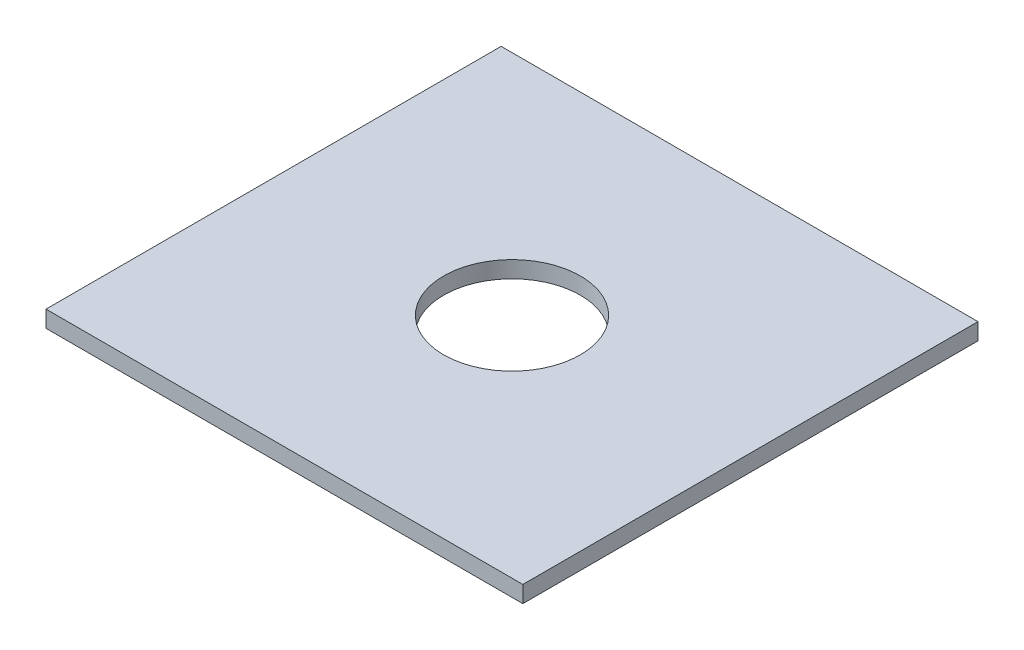
ISO-10303-21;
HEADER;
FILE_DESCRIPTION(('STEP AP214'),'2;1');
FILE_NAME('part.step','',(''),(''),'','','');
FILE_SCHEMA(('AUTOMOTIVE_DESIGN { 1 0 10303 214 1 1 1 1 }'));
ENDSEC;
DATA;
#1=APPLICATION_CONTEXT('core data for automotive mechanical design processes');
#2=APPLICATION_PROTOCOL_DEFINITION('international standard','automotive_design',2000,#1);
#3=PRODUCT_CONTEXT('',#1,'mechanical');
#4=PRODUCT('Part','Part','',(#3));
#5=PRODUCT_RELATED_PRODUCT_CATEGORY('part','',(#4));
#6=PRODUCT_DEFINITION_FORMATION('','',#4);
#7=PRODUCT_DEFINITION_CONTEXT('part definition',#1,'design');
#8=PRODUCT_DEFINITION('design','',#6,#7);
#9=PRODUCT_DEFINITION_SHAPE('','',#8);
#10=(LENGTH_UNIT() NAMED_UNIT(*) SI_UNIT(.MILLI.,.METRE.));
#11=(NAMED_UNIT(*) PLANE_ANGLE_UNIT() SI_UNIT($,.RADIAN.));
#12=(NAMED_UNIT(*) SI_UNIT($,.STERADIAN.) SOLID_ANGLE_UNIT());
#13=UNCERTAINTY_MEASURE_WITH_UNIT(LENGTH_MEASURE(1.E-05),#10,'distance_accuracy_value','');
#14=(GEOMETRIC_REPRESENTATION_CONTEXT(3) GLOBAL_UNCERTAINTY_ASSIGNED_CONTEXT((#13)) GLOBAL_UNIT_ASSIGNED_CONTEXT((#10,
#11,#12)) REPRESENTATION_CONTEXT('',''));
#15=CARTESIAN_POINT('',(0.,0.,0.));
#16=DIRECTION('',(0.,0.,1.));
#17=DIRECTION('',(1.,0.,0.));
#18=AXIS2_PLACEMENT_3D('',#15,#16,#17);
#19=CARTESIAN_POINT('',(0.,10.,0.));
#20=DIRECTION('',(0.,1.,0.));
#21=DIRECTION('',(0.,0.,1.));
#22=AXIS2_PLACEMENT_3D('',#19,#20,#21);
#23=PLANE('',#22);
#24=DIRECTION('',(0.,0.,1.));
#25=VECTOR('',#24,1.);
#26=CARTESIAN_POINT('',(-143.,10.,136.5));
#27=LINE('',#26,#25);
#28=CARTESIAN_POINT('',(-143.,10.,-136.5));
#29=VERTEX_POINT('',#28);
#30=CARTESIAN_POINT('',(-143.,10.,136.5));
#31=VERTEX_POINT('',#30);
#32=EDGE_CURVE('E93',#29,#31,#27,.T.);
#33=ORIENTED_EDGE('',*,*,#32,.T.);
#34=DIRECTION('',(1.,0.,0.));
#35=VECTOR('',#34,1.);
#36=CARTESIAN_POINT('',(143.,10.,136.5));
#37=LINE('',#36,#35);
#38=CARTESIAN_POINT('',(143.,10.,136.5));
#39=VERTEX_POINT('',#38);
#40=EDGE_CURVE('E88',#31,#39,#37,.T.);
#41=ORIENTED_EDGE('',*,*,#40,.T.);
#42=DIRECTION('',(0.,0.,-1.));
#43=VECTOR('',#42,1.);
#44=CARTESIAN_POINT('',(143.,10.,136.5));
#45=LINE('',#44,#43);
#46=CARTESIAN_POINT('',(143.,10.,-136.5));
#47=VERTEX_POINT('',#46);
#48=EDGE_CURVE('E91',#39,#47,#45,.T.);
#49=ORIENTED_EDGE('',*,*,#48,.T.);
#50=DIRECTION('',(-1.,0.,0.));
#51=VECTOR('',#50,1.);
#52=CARTESIAN_POINT('',(143.,10.,-136.5));
#53=LINE('',#52,#51);
#54=EDGE_CURVE('E58',#47,#29,#53,.T.);
#55=ORIENTED_EDGE('',*,*,#54,.T.);
#56=EDGE_LOOP('',(#33,#41,#49,#55));
#57=FACE_BOUND('',#56,.T.);
#58=CARTESIAN_POINT('',(0.,10.,0.));
#59=DIRECTION('',(0.,1.,0.));
#60=DIRECTION('',(0.,0.,1.));
#61=AXIS2_PLACEMENT_3D('',#58,#59,#60);
#62=CIRCLE('',#61,41.);
#63=CARTESIAN_POINT('',(0.,10.,41.0000000000001));
#64=VERTEX_POINT('',#63);
#65=EDGE_CURVE('E108',#64,#64,#62,.T.);
#66=ORIENTED_EDGE('',*,*,#65,.F.);
#67=EDGE_LOOP('',(#66));
#68=FACE_BOUND('',#67,.T.);
#69=ADVANCED_FACE('F41',(#57,#68),#23,.T.);
#70=CARTESIAN_POINT('',(0.,0.,0.));
#71=DIRECTION('',(0.,1.,0.));
#72=DIRECTION('',(0.,0.,1.));
#73=AXIS2_PLACEMENT_3D('',#70,#71,#72);
#74=PLANE('',#73);
#75=DIRECTION('',(0.,0.,1.));
#76=VECTOR('',#75,1.);
#77=CARTESIAN_POINT('',(-143.,0.,136.5));
#78=LINE('',#77,#76);
#79=CARTESIAN_POINT('',(-143.,0.,-136.5));
#80=VERTEX_POINT('',#79);
#81=CARTESIAN_POINT('',(-143.,0.,136.5));
#82=VERTEX_POINT('',#81);
#83=EDGE_CURVE('E105',#80,#82,#78,.T.);
#84=ORIENTED_EDGE('',*,*,#83,.F.);
#85=DIRECTION('',(-1.,0.,0.));
#86=VECTOR('',#85,1.);
#87=CARTESIAN_POINT('',(143.,0.,-136.5));
#88=LINE('',#87,#86);
#89=CARTESIAN_POINT('',(143.,0.,-136.5));
#90=VERTEX_POINT('',#89);
#91=EDGE_CURVE('E81',#90,#80,#88,.T.);
#92=ORIENTED_EDGE('',*,*,#91,.F.);
#93=DIRECTION('',(0.,0.,-1.));
#94=VECTOR('',#93,1.);
#95=CARTESIAN_POINT('',(143.,0.,136.5));
#96=LINE('',#95,#94);
#97=CARTESIAN_POINT('',(143.,0.,136.5));
#98=VERTEX_POINT('',#97);
#99=EDGE_CURVE('E75',#98,#90,#96,.T.);
#100=ORIENTED_EDGE('',*,*,#99,.F.);
#101=DIRECTION('',(1.,0.,0.));
#102=VECTOR('',#101,1.);
#103=CARTESIAN_POINT('',(143.,0.,136.5));
#104=LINE('',#103,#102);
#105=EDGE_CURVE('E97',#82,#98,#104,.T.);
#106=ORIENTED_EDGE('',*,*,#105,.F.);
#107=EDGE_LOOP('',(#84,#92,#100,#106));
#108=FACE_BOUND('',#107,.T.);
#109=CARTESIAN_POINT('',(0.,0.,0.));
#110=DIRECTION('',(0.,1.,0.));
#111=DIRECTION('',(0.,0.,1.));
#112=AXIS2_PLACEMENT_3D('',#109,#110,#111);
#113=CIRCLE('',#112,41.);
#114=CARTESIAN_POINT('',(0.,0.,41.0000000000001));
#115=VERTEX_POINT('',#114);
#116=EDGE_CURVE('E120',#115,#115,#113,.T.);
#117=ORIENTED_EDGE('',*,*,#116,.T.);
#118=EDGE_LOOP('',(#117));
#119=FACE_BOUND('',#118,.T.);
#120=ADVANCED_FACE('F116',(#108,#119),#74,.F.);
#121=CARTESIAN_POINT('',(-143.,10.,136.5));
#122=DIRECTION('',(1.,0.,0.));
#123=DIRECTION('',(0.,0.,-1.));
#124=AXIS2_PLACEMENT_3D('',#121,#122,#123);
#125=PLANE('',#124);
#126=ORIENTED_EDGE('',*,*,#83,.T.);
#127=DIRECTION('',(0.,-1.,0.));
#128=VECTOR('',#127,1.);
#129=CARTESIAN_POINT('',(-143.,10.,136.5));
#130=LINE('',#129,#128);
#131=EDGE_CURVE('E11',#31,#82,#130,.T.);
#132=ORIENTED_EDGE('',*,*,#131,.F.);
#133=ORIENTED_EDGE('',*,*,#32,.F.);
#134=DIRECTION('',(0.,-1.,0.));
#135=VECTOR('',#134,1.);
#136=CARTESIAN_POINT('',(-143.,10.,-136.5));
#137=LINE('',#136,#135);
#138=EDGE_CURVE('E101',#29,#80,#137,.T.);
#139=ORIENTED_EDGE('',*,*,#138,.T.);
#140=EDGE_LOOP('',(#126,#132,#133,#139));
#141=FACE_BOUND('',#140,.T.);
#142=ADVANCED_FACE('F43',(#141),#125,.F.);
#143=CARTESIAN_POINT('',(143.,10.,136.5));
#144=DIRECTION('',(0.,0.,-1.));
#145=DIRECTION('',(-1.,0.,0.));
#146=AXIS2_PLACEMENT_3D('',#143,#144,#145);
#147=PLANE('',#146);
#148=ORIENTED_EDGE('',*,*,#105,.T.);
#149=DIRECTION('',(0.,-1.,0.));
#150=VECTOR('',#149,1.);
#151=CARTESIAN_POINT('',(143.,10.,136.5));
#152=LINE('',#151,#150);
#153=EDGE_CURVE('E50',#39,#98,#152,.T.);
#154=ORIENTED_EDGE('',*,*,#153,.F.);
#155=ORIENTED_EDGE('',*,*,#40,.F.);
#156=ORIENTED_EDGE('',*,*,#131,.T.);
#157=EDGE_LOOP('',(#148,#154,#155,#156));
#158=FACE_BOUND('',#157,.T.);
#159=ADVANCED_FACE('F96',(#158),#147,.F.);
#160=CARTESIAN_POINT('',(143.,10.,136.5));
#161=DIRECTION('',(-1.,0.,0.));
#162=DIRECTION('',(0.,0.,1.));
#163=AXIS2_PLACEMENT_3D('',#160,#161,#162);
#164=PLANE('',#163);
#165=ORIENTED_EDGE('',*,*,#99,.T.);
#166=DIRECTION('',(0.,-1.,0.));
#167=VECTOR('',#166,1.);
#168=CARTESIAN_POINT('',(143.,10.,-136.5));
#169=LINE('',#168,#167);
#170=EDGE_CURVE('E98',#47,#90,#169,.T.);
#171=ORIENTED_EDGE('',*,*,#170,.F.);
#172=ORIENTED_EDGE('',*,*,#48,.F.);
#173=ORIENTED_EDGE('',*,*,#153,.T.);
#174=EDGE_LOOP('',(#165,#171,#172,#173));
#175=FACE_BOUND('',#174,.T.);
#176=ADVANCED_FACE('F99',(#175),#164,.F.);
#177=CARTESIAN_POINT('',(143.,10.,-136.5));
#178=DIRECTION('',(0.,0.,1.));
#179=DIRECTION('',(1.,0.,0.));
#180=AXIS2_PLACEMENT_3D('',#177,#178,#179);
#181=PLANE('',#180);
#182=ORIENTED_EDGE('',*,*,#91,.T.);
#183=ORIENTED_EDGE('',*,*,#138,.F.);
#184=ORIENTED_EDGE('',*,*,#54,.F.);
#185=ORIENTED_EDGE('',*,*,#170,.T.);
#186=EDGE_LOOP('',(#182,#183,#184,#185));
#187=FACE_BOUND('',#186,.T.);
#188=ADVANCED_FACE('F113',(#187),#181,.F.);
#189=CARTESIAN_POINT('',(0.,10.,0.));
#190=DIRECTION('',(0.,-1.,0.));
#191=DIRECTION('',(0.,0.,-1.));
#192=AXIS2_PLACEMENT_3D('',#189,#190,#191);
#193=CYLINDRICAL_SURFACE('',#192,41.);
#194=ORIENTED_EDGE('',*,*,#65,.T.);
#195=EDGE_LOOP('',(#194));
#196=FACE_BOUND('',#195,.T.);
#197=ORIENTED_EDGE('',*,*,#116,.F.);
#198=EDGE_LOOP('',(#197));
#199=FACE_BOUND('',#198,.T.);
#200=ADVANCED_FACE('F126',(#196,#199),#193,.F.);
#201=CLOSED_SHELL('',(#69,#120,#142,#159,#176,#188,#200));
#202=MANIFOLD_SOLID_BREP('B2',#201);
#203=ADVANCED_BREP_SHAPE_REPRESENTATION('',(#18,#202),#14);
#204=SHAPE_DEFINITION_REPRESENTATION(#9,#203);
ENDSEC;
END-ISO-10303-21;
